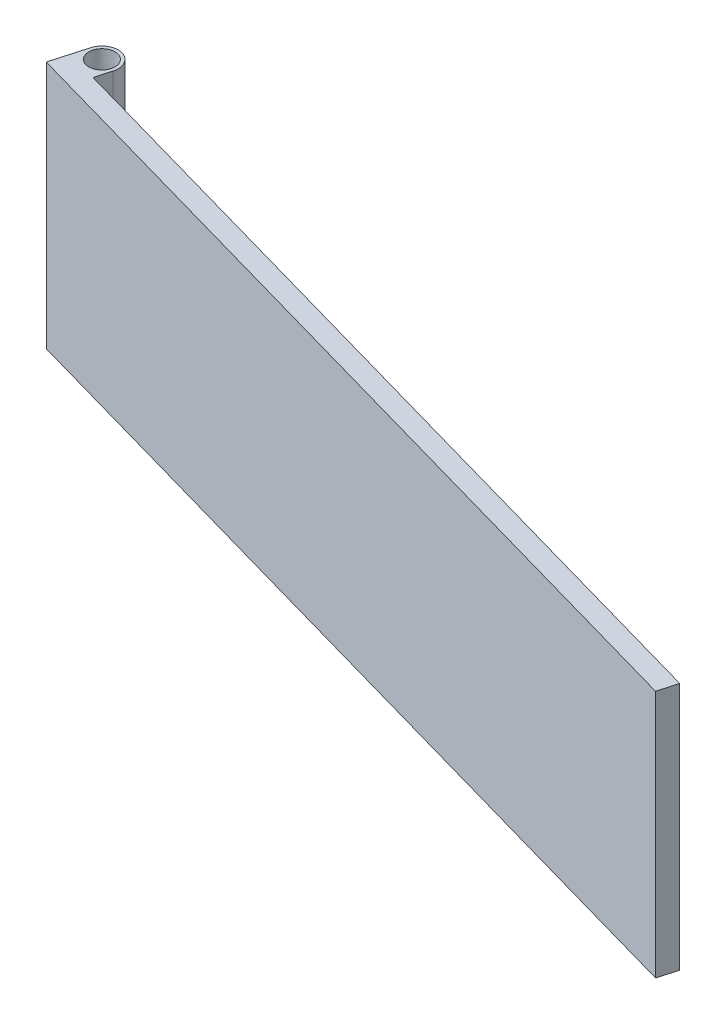
ISO-10303-21;
HEADER;
FILE_DESCRIPTION(('STEP AP214'),'2;1');
FILE_NAME('part.step','',(''),(''),'','','');
FILE_SCHEMA(('AUTOMOTIVE_DESIGN { 1 0 10303 214 1 1 1 1 }'));
ENDSEC;
DATA;
#1=APPLICATION_CONTEXT('core data for automotive mechanical design processes');
#2=APPLICATION_PROTOCOL_DEFINITION('international standard','automotive_design',2000,#1);
#3=PRODUCT_CONTEXT('',#1,'mechanical');
#4=PRODUCT('Part','Part','',(#3));
#5=PRODUCT_RELATED_PRODUCT_CATEGORY('part','',(#4));
#6=PRODUCT_DEFINITION_FORMATION('','',#4);
#7=PRODUCT_DEFINITION_CONTEXT('part definition',#1,'design');
#8=PRODUCT_DEFINITION('design','',#6,#7);
#9=PRODUCT_DEFINITION_SHAPE('','',#8);
#10=(LENGTH_UNIT() NAMED_UNIT(*) SI_UNIT(.MILLI.,.METRE.));
#11=(NAMED_UNIT(*) PLANE_ANGLE_UNIT() SI_UNIT($,.RADIAN.));
#12=(NAMED_UNIT(*) SI_UNIT($,.STERADIAN.) SOLID_ANGLE_UNIT());
#13=UNCERTAINTY_MEASURE_WITH_UNIT(LENGTH_MEASURE(1.E-05),#10,'distance_accuracy_value','');
#14=(GEOMETRIC_REPRESENTATION_CONTEXT(3) GLOBAL_UNCERTAINTY_ASSIGNED_CONTEXT((#13)) GLOBAL_UNIT_ASSIGNED_CONTEXT((#10,
#11,#12)) REPRESENTATION_CONTEXT('',''));
#15=CARTESIAN_POINT('',(0.,0.,0.));
#16=DIRECTION('',(0.,0.,1.));
#17=DIRECTION('',(1.,0.,0.));
#18=AXIS2_PLACEMENT_3D('',#15,#16,#17);
#19=CARTESIAN_POINT('',(-5.60113821836263,1.9,6.11628696544364));
#20=DIRECTION('',(0.962248672431212,0.,0.27217180677721));
#21=DIRECTION('',(0.27217180677721,0.,-0.962248672431212));
#22=AXIS2_PLACEMENT_3D('',#19,#20,#21);
#23=PLANE('',#22);
#24=DIRECTION('',(0.,1.,0.));
#25=VECTOR('',#24,1.);
#26=CARTESIAN_POINT('',(-5.73722412175123,0.,6.59741130165925));
#27=LINE('',#26,#25);
#28=CARTESIAN_POINT('',(-5.73722412175123,-1.9,6.59741130165924));
#29=VERTEX_POINT('',#28);
#30=CARTESIAN_POINT('',(-5.73722412175123,1.9,6.59741130165925));
#31=VERTEX_POINT('',#30);
#32=EDGE_CURVE('E97',#29,#31,#27,.T.);
#33=ORIENTED_EDGE('',*,*,#32,.F.);
#34=DIRECTION('',(0.27217180677721,0.,-0.962248672431212));
#35=VECTOR('',#34,1.);
#36=CARTESIAN_POINT('',(-5.60113821836263,-1.9,6.11628696544364));
#37=LINE('',#36,#35);
#38=CARTESIAN_POINT('',(-5.66918117005693,-1.9,6.35684913355144));
#39=VERTEX_POINT('',#38);
#40=EDGE_CURVE('E83',#29,#39,#37,.T.);
#41=ORIENTED_EDGE('',*,*,#40,.T.);
#42=DIRECTION('',(0.,-1.,0.));
#43=VECTOR('',#42,1.);
#44=CARTESIAN_POINT('',(-5.66918117005693,1.9,6.35684913355144));
#45=LINE('',#44,#43);
#46=CARTESIAN_POINT('',(-5.66918117005693,1.9,6.35684913355144));
#47=VERTEX_POINT('',#46);
#48=EDGE_CURVE('E94',#47,#39,#45,.T.);
#49=ORIENTED_EDGE('',*,*,#48,.F.);
#50=DIRECTION('',(0.27217180677721,0.,-0.962248672431212));
#51=VECTOR('',#50,1.);
#52=CARTESIAN_POINT('',(-5.60113821836263,1.9,6.11628696544364));
#53=LINE('',#52,#51);
#54=EDGE_CURVE('E100',#47,#31,#53,.F.);
#55=ORIENTED_EDGE('',*,*,#54,.T.);
#56=EDGE_LOOP('',(#33,#41,#49,#55));
#57=FACE_BOUND('',#56,.T.);
#58=ADVANCED_FACE('F16',(#57),#23,.T.);
#59=CARTESIAN_POINT('',(-5.90974333816473,1.9,6.28880618185714));
#60=DIRECTION('',(0.,-1.,0.));
#61=DIRECTION('',(0.,0.,-1.));
#62=AXIS2_PLACEMENT_3D('',#59,#60,#61);
#63=CYLINDRICAL_SURFACE('',#62,0.25);
#64=CARTESIAN_POINT('',(-5.90974333816473,1.9,6.28880618185714));
#65=DIRECTION('',(0.,-1.,0.));
#66=DIRECTION('',(0.,0.,-1.));
#67=AXIS2_PLACEMENT_3D('',#64,#65,#66);
#68=CIRCLE('',#67,0.25);
#69=CARTESIAN_POINT('',(-6.15030550627254,1.9,6.22076323016284));
#70=VERTEX_POINT('',#69);
#71=EDGE_CURVE('E91',#70,#47,#68,.T.);
#72=ORIENTED_EDGE('',*,*,#71,.T.);
#73=ORIENTED_EDGE('',*,*,#48,.T.);
#74=CARTESIAN_POINT('',(-5.90974333816473,-1.9,6.28880618185714));
#75=DIRECTION('',(0.,-1.,0.));
#76=DIRECTION('',(0.,0.,-1.));
#77=AXIS2_PLACEMENT_3D('',#74,#75,#76);
#78=CIRCLE('',#77,0.25);
#79=CARTESIAN_POINT('',(-6.15030550627254,-1.9,6.22076323016284));
#80=VERTEX_POINT('',#79);
#81=EDGE_CURVE('E19',#39,#80,#78,.F.);
#82=ORIENTED_EDGE('',*,*,#81,.T.);
#83=DIRECTION('',(0.,1.,0.));
#84=VECTOR('',#83,1.);
#85=CARTESIAN_POINT('',(-6.15030550627253,-1.9,6.22076323016283));
#86=LINE('',#85,#84);
#87=EDGE_CURVE('E108',#70,#80,#86,.F.);
#88=ORIENTED_EDGE('',*,*,#87,.F.);
#89=EDGE_LOOP('',(#72,#73,#82,#88));
#90=FACE_BOUND('',#89,.T.);
#91=ADVANCED_FACE('F102',(#90),#63,.T.);
#92=CARTESIAN_POINT('',(0.281651542033163,0.,8.29984884313238));
#93=DIRECTION('',(0.27217180677721,0.,-0.962248672431212));
#94=DIRECTION('',(-0.962248672431212,0.,-0.27217180677721));
#95=AXIS2_PLACEMENT_3D('',#92,#93,#94);
#96=PLANE('',#95);
#97=DIRECTION('',(0.,1.,0.));
#98=VECTOR('',#97,1.);
#99=CARTESIAN_POINT('',(6.78165154203317,1.9,10.1383722879941));
#100=LINE('',#99,#98);
#101=CARTESIAN_POINT('',(6.78165154203317,-1.9,10.1383722879941));
#102=VERTEX_POINT('',#101);
#103=CARTESIAN_POINT('',(6.78165154203317,1.9,10.1383722879941));
#104=VERTEX_POINT('',#103);
#105=EDGE_CURVE('E148',#102,#104,#100,.T.);
#106=ORIENTED_EDGE('',*,*,#105,.F.);
#107=DIRECTION('',(0.962248672431212,0.,0.272171806777209));
#108=VECTOR('',#107,1.);
#109=CARTESIAN_POINT('',(-5.73722412175123,-1.9,6.59741130165924));
#110=LINE('',#109,#108);
#111=EDGE_CURVE('E123',#29,#102,#110,.T.);
#112=ORIENTED_EDGE('',*,*,#111,.F.);
#113=ORIENTED_EDGE('',*,*,#32,.T.);
#114=DIRECTION('',(-0.962248672431212,0.,-0.272171806777209));
#115=VECTOR('',#114,1.);
#116=CARTESIAN_POINT('',(6.78165154203317,1.9,10.1383722879941));
#117=LINE('',#116,#115);
#118=EDGE_CURVE('E128',#104,#31,#117,.T.);
#119=ORIENTED_EDGE('',*,*,#118,.F.);
#120=EDGE_LOOP('',(#106,#112,#113,#119));
#121=FACE_BOUND('',#120,.T.);
#122=ADVANCED_FACE('F182',(#121),#96,.T.);
#123=CARTESIAN_POINT('',(-5.90974333816473,1.9,6.28880618185714));
#124=DIRECTION('',(0.,-1.,0.));
#125=DIRECTION('',(0.,0.,-1.));
#126=AXIS2_PLACEMENT_3D('',#123,#124,#125);
#127=CYLINDRICAL_SURFACE('',#126,0.2);
#128=CARTESIAN_POINT('',(-5.90974333816473,-1.9,6.28880618185714));
#129=DIRECTION('',(0.,-1.,0.));
#130=DIRECTION('',(0.,0.,-1.));
#131=AXIS2_PLACEMENT_3D('',#128,#129,#130);
#132=CIRCLE('',#131,0.2);
#133=CARTESIAN_POINT('',(-5.90974333816473,-1.9,6.08880618185714));
#134=VERTEX_POINT('',#133);
#135=EDGE_CURVE('E139',#134,#134,#132,.F.);
#136=ORIENTED_EDGE('',*,*,#135,.F.);
#137=EDGE_LOOP('',(#136));
#138=FACE_BOUND('',#137,.T.);
#139=CARTESIAN_POINT('',(-5.90974333816473,1.9,6.28880618185714));
#140=DIRECTION('',(0.,-1.,0.));
#141=DIRECTION('',(0.,0.,-1.));
#142=AXIS2_PLACEMENT_3D('',#139,#140,#141);
#143=CIRCLE('',#142,0.2);
#144=CARTESIAN_POINT('',(-5.90974333816473,1.9,6.08880618185714));
#145=VERTEX_POINT('',#144);
#146=EDGE_CURVE('E132',#145,#145,#143,.T.);
#147=ORIENTED_EDGE('',*,*,#146,.F.);
#148=EDGE_LOOP('',(#147));
#149=FACE_BOUND('',#148,.T.);
#150=ADVANCED_FACE('F192',(#138,#149),#127,.F.);
#151=CARTESIAN_POINT('',(-6.3,-1.9,6.75));
#152=DIRECTION('',(-0.962248672431212,0.,-0.27217180677721));
#153=DIRECTION('',(-0.27217180677721,0.,0.962248672431212));
#154=AXIS2_PLACEMENT_3D('',#151,#152,#153);
#155=PLANE('',#154);
#156=DIRECTION('',(0.,1.,0.));
#157=VECTOR('',#156,1.);
#158=CARTESIAN_POINT('',(-6.3,0.,6.75));
#159=LINE('',#158,#157);
#160=CARTESIAN_POINT('',(-6.3,1.9,6.75));
#161=VERTEX_POINT('',#160);
#162=CARTESIAN_POINT('',(-6.3,-1.9,6.75));
#163=VERTEX_POINT('',#162);
#164=EDGE_CURVE('E138',#161,#163,#159,.F.);
#165=ORIENTED_EDGE('',*,*,#164,.F.);
#166=DIRECTION('',(-0.2721718067772,0.,0.962248672431214));
#167=VECTOR('',#166,1.);
#168=CARTESIAN_POINT('',(-6.15030550627254,1.9,6.22076323016283));
#169=LINE('',#168,#167);
#170=EDGE_CURVE('E173',#70,#161,#169,.T.);
#171=ORIENTED_EDGE('',*,*,#170,.F.);
#172=ORIENTED_EDGE('',*,*,#87,.T.);
#173=DIRECTION('',(0.2721718067772,0.,-0.962248672431214));
#174=VECTOR('',#173,1.);
#175=CARTESIAN_POINT('',(-6.3,-1.9,6.75));
#176=LINE('',#175,#174);
#177=EDGE_CURVE('E85',#163,#80,#176,.T.);
#178=ORIENTED_EDGE('',*,*,#177,.F.);
#179=EDGE_LOOP('',(#165,#171,#172,#178));
#180=FACE_BOUND('',#179,.T.);
#181=ADVANCED_FACE('F188',(#180),#155,.T.);
#182=CARTESIAN_POINT('',(6.7,-1.9,10.4270468897235));
#183=DIRECTION('',(0.,-1.,0.));
#184=DIRECTION('',(1.,0.,0.));
#185=AXIS2_PLACEMENT_3D('',#182,#183,#184);
#186=PLANE('',#185);
#187=ORIENTED_EDGE('',*,*,#135,.T.);
#188=EDGE_LOOP('',(#187));
#189=FACE_BOUND('',#188,.T.);
#190=DIRECTION('',(0.962248672431212,0.,0.27217180677721));
#191=VECTOR('',#190,1.);
#192=CARTESIAN_POINT('',(0.199999999999999,-1.9,8.58852344486174));
#193=LINE('',#192,#191);
#194=CARTESIAN_POINT('',(6.7,-1.9,10.4270468897235));
#195=VERTEX_POINT('',#194);
#196=EDGE_CURVE('E159',#163,#195,#193,.T.);
#197=ORIENTED_EDGE('',*,*,#196,.F.);
#198=ORIENTED_EDGE('',*,*,#177,.T.);
#199=ORIENTED_EDGE('',*,*,#81,.F.);
#200=ORIENTED_EDGE('',*,*,#40,.F.);
#201=ORIENTED_EDGE('',*,*,#111,.T.);
#202=DIRECTION('',(0.27217180677721,0.,-0.962248672431212));
#203=VECTOR('',#202,1.);
#204=CARTESIAN_POINT('',(6.7,-1.9,10.4270468897235));
#205=LINE('',#204,#203);
#206=EDGE_CURVE('E142',#195,#102,#205,.T.);
#207=ORIENTED_EDGE('',*,*,#206,.F.);
#208=EDGE_LOOP('',(#197,#198,#199,#200,#201,#207));
#209=FACE_BOUND('',#208,.T.);
#210=ADVANCED_FACE('F82',(#189,#209),#186,.T.);
#211=CARTESIAN_POINT('',(6.7,1.9,10.4270468897235));
#212=DIRECTION('',(0.962248672431212,0.,0.27217180677721));
#213=DIRECTION('',(0.27217180677721,0.,-0.962248672431212));
#214=AXIS2_PLACEMENT_3D('',#211,#212,#213);
#215=PLANE('',#214);
#216=ORIENTED_EDGE('',*,*,#105,.T.);
#217=DIRECTION('',(0.272171806777202,0.,-0.962248672431214));
#218=VECTOR('',#217,1.);
#219=CARTESIAN_POINT('',(6.7,1.9,10.4270468897235));
#220=LINE('',#219,#218);
#221=CARTESIAN_POINT('',(6.7,1.9,10.4270468897235));
#222=VERTEX_POINT('',#221);
#223=EDGE_CURVE('E39',#222,#104,#220,.T.);
#224=ORIENTED_EDGE('',*,*,#223,.F.);
#225=DIRECTION('',(0.,1.,0.));
#226=VECTOR('',#225,1.);
#227=CARTESIAN_POINT('',(6.70000000000001,0.,10.4270468897235));
#228=LINE('',#227,#226);
#229=EDGE_CURVE('E26',#195,#222,#228,.T.);
#230=ORIENTED_EDGE('',*,*,#229,.F.);
#231=ORIENTED_EDGE('',*,*,#206,.T.);
#232=EDGE_LOOP('',(#216,#224,#230,#231));
#233=FACE_BOUND('',#232,.T.);
#234=ADVANCED_FACE('F180',(#233),#215,.T.);
#235=CARTESIAN_POINT('',(-6.3,1.9,6.75));
#236=DIRECTION('',(0.,1.,0.));
#237=DIRECTION('',(-1.,0.,0.));
#238=AXIS2_PLACEMENT_3D('',#235,#236,#237);
#239=PLANE('',#238);
#240=ORIENTED_EDGE('',*,*,#146,.T.);
#241=EDGE_LOOP('',(#240));
#242=FACE_BOUND('',#241,.T.);
#243=ORIENTED_EDGE('',*,*,#118,.T.);
#244=ORIENTED_EDGE('',*,*,#54,.F.);
#245=ORIENTED_EDGE('',*,*,#71,.F.);
#246=ORIENTED_EDGE('',*,*,#170,.T.);
#247=DIRECTION('',(0.962248672431212,0.,0.27217180677721));
#248=VECTOR('',#247,1.);
#249=CARTESIAN_POINT('',(0.199999999999999,1.9,8.58852344486174));
#250=LINE('',#249,#248);
#251=EDGE_CURVE('E11',#222,#161,#250,.F.);
#252=ORIENTED_EDGE('',*,*,#251,.F.);
#253=ORIENTED_EDGE('',*,*,#223,.T.);
#254=EDGE_LOOP('',(#243,#244,#245,#246,#252,#253));
#255=FACE_BOUND('',#254,.T.);
#256=ADVANCED_FACE('F184',(#242,#255),#239,.T.);
#257=CARTESIAN_POINT('',(0.199999999999999,0.,8.58852344486174));
#258=DIRECTION('',(-0.27217180677721,0.,0.962248672431212));
#259=DIRECTION('',(0.962248672431212,0.,0.27217180677721));
#260=AXIS2_PLACEMENT_3D('',#257,#258,#259);
#261=PLANE('',#260);
#262=ORIENTED_EDGE('',*,*,#229,.T.);
#263=ORIENTED_EDGE('',*,*,#251,.T.);
#264=ORIENTED_EDGE('',*,*,#164,.T.);
#265=ORIENTED_EDGE('',*,*,#196,.T.);
#266=EDGE_LOOP('',(#262,#263,#264,#265));
#267=FACE_BOUND('',#266,.T.);
#268=ADVANCED_FACE('F186',(#267),#261,.T.);
#269=CLOSED_SHELL('',(#58,#91,#122,#150,#181,#210,#234,#256,#268));
#270=MANIFOLD_SOLID_BREP('B1',#269);
#271=ADVANCED_BREP_SHAPE_REPRESENTATION('',(#18,#270),#14);
#272=SHAPE_DEFINITION_REPRESENTATION(#9,#271);
ENDSEC;
END-ISO-10303-21;
